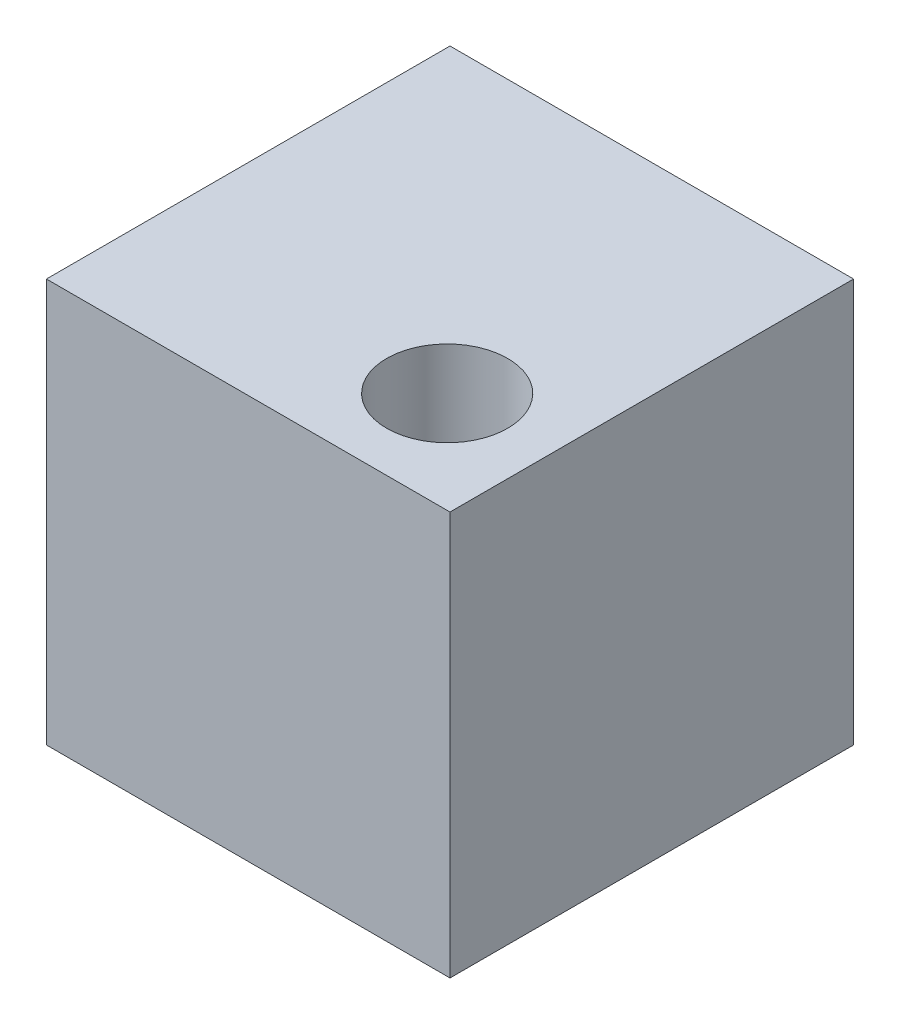
ISO-10303-21;
HEADER;
FILE_DESCRIPTION(('STEP AP214'),'2;1');
FILE_NAME('part.step','',(''),(''),'','','');
FILE_SCHEMA(('AUTOMOTIVE_DESIGN { 1 0 10303 214 1 1 1 1 }'));
ENDSEC;
DATA;
#1=APPLICATION_CONTEXT('core data for automotive mechanical design processes');
#2=APPLICATION_PROTOCOL_DEFINITION('international standard','automotive_design',2000,#1);
#3=PRODUCT_CONTEXT('',#1,'mechanical');
#4=PRODUCT('Part','Part','',(#3));
#5=PRODUCT_RELATED_PRODUCT_CATEGORY('part','',(#4));
#6=PRODUCT_DEFINITION_FORMATION('','',#4);
#7=PRODUCT_DEFINITION_CONTEXT('part definition',#1,'design');
#8=PRODUCT_DEFINITION('design','',#6,#7);
#9=PRODUCT_DEFINITION_SHAPE('','',#8);
#10=(LENGTH_UNIT() NAMED_UNIT(*) SI_UNIT(.MILLI.,.METRE.));
#11=(NAMED_UNIT(*) PLANE_ANGLE_UNIT() SI_UNIT($,.RADIAN.));
#12=(NAMED_UNIT(*) SI_UNIT($,.STERADIAN.) SOLID_ANGLE_UNIT());
#13=UNCERTAINTY_MEASURE_WITH_UNIT(LENGTH_MEASURE(1.E-05),#10,'distance_accuracy_value','');
#14=(GEOMETRIC_REPRESENTATION_CONTEXT(3) GLOBAL_UNCERTAINTY_ASSIGNED_CONTEXT((#13)) GLOBAL_UNIT_ASSIGNED_CONTEXT((#10,
#11,#12)) REPRESENTATION_CONTEXT('',''));
#15=CARTESIAN_POINT('',(0.,0.,0.));
#16=DIRECTION('',(0.,0.,1.));
#17=DIRECTION('',(1.,0.,0.));
#18=AXIS2_PLACEMENT_3D('',#15,#16,#17);
#19=CARTESIAN_POINT('',(-3.6626417244427,10.,-2.19383304201823));
#20=DIRECTION('',(1.,0.,0.));
#21=DIRECTION('',(0.,0.,-1.));
#22=AXIS2_PLACEMENT_3D('',#19,#20,#21);
#23=PLANE('',#22);
#24=DIRECTION('',(0.,0.,1.));
#25=VECTOR('',#24,1.);
#26=CARTESIAN_POINT('',(-3.6626417244427,0.,-2.19383304201823));
#27=LINE('',#26,#25);
#28=CARTESIAN_POINT('',(-3.6626417244427,0.,-2.19383304201823));
#29=VERTEX_POINT('',#28);
#30=CARTESIAN_POINT('',(-3.6626417244427,0.,7.80616695798177));
#31=VERTEX_POINT('',#30);
#32=EDGE_CURVE('E96',#29,#31,#27,.T.);
#33=ORIENTED_EDGE('',*,*,#32,.T.);
#34=DIRECTION('',(0.,-1.,0.));
#35=VECTOR('',#34,1.);
#36=CARTESIAN_POINT('',(-3.6626417244427,10.,7.80616695798177));
#37=LINE('',#36,#35);
#38=CARTESIAN_POINT('',(-3.6626417244427,10.,7.80616695798177));
#39=VERTEX_POINT('',#38);
#40=EDGE_CURVE('E11',#39,#31,#37,.T.);
#41=ORIENTED_EDGE('',*,*,#40,.F.);
#42=DIRECTION('',(0.,0.,1.));
#43=VECTOR('',#42,1.);
#44=CARTESIAN_POINT('',(-3.6626417244427,10.,-2.19383304201823));
#45=LINE('',#44,#43);
#46=CARTESIAN_POINT('',(-3.6626417244427,10.,-2.19383304201823));
#47=VERTEX_POINT('',#46);
#48=EDGE_CURVE('E84',#47,#39,#45,.T.);
#49=ORIENTED_EDGE('',*,*,#48,.F.);
#50=DIRECTION('',(0.,-1.,0.));
#51=VECTOR('',#50,1.);
#52=CARTESIAN_POINT('',(-3.6626417244427,10.,-2.19383304201823));
#53=LINE('',#52,#51);
#54=EDGE_CURVE('E92',#47,#29,#53,.T.);
#55=ORIENTED_EDGE('',*,*,#54,.T.);
#56=EDGE_LOOP('',(#33,#41,#49,#55));
#57=FACE_BOUND('',#56,.T.);
#58=ADVANCED_FACE('F33',(#57),#23,.F.);
#59=CARTESIAN_POINT('',(-3.6626417244427,10.,7.80616695798177));
#60=DIRECTION('',(0.,0.,-1.));
#61=DIRECTION('',(-1.,0.,0.));
#62=AXIS2_PLACEMENT_3D('',#59,#60,#61);
#63=PLANE('',#62);
#64=DIRECTION('',(1.,0.,0.));
#65=VECTOR('',#64,1.);
#66=CARTESIAN_POINT('',(-3.6626417244427,0.,7.80616695798177));
#67=LINE('',#66,#65);
#68=CARTESIAN_POINT('',(6.3373582755573,0.,7.80616695798177));
#69=VERTEX_POINT('',#68);
#70=EDGE_CURVE('E88',#31,#69,#67,.T.);
#71=ORIENTED_EDGE('',*,*,#70,.T.);
#72=DIRECTION('',(0.,-1.,0.));
#73=VECTOR('',#72,1.);
#74=CARTESIAN_POINT('',(6.3373582755573,10.,7.80616695798177));
#75=LINE('',#74,#73);
#76=CARTESIAN_POINT('',(6.3373582755573,10.,7.80616695798177));
#77=VERTEX_POINT('',#76);
#78=EDGE_CURVE('E41',#77,#69,#75,.T.);
#79=ORIENTED_EDGE('',*,*,#78,.F.);
#80=DIRECTION('',(1.,0.,0.));
#81=VECTOR('',#80,1.);
#82=CARTESIAN_POINT('',(-3.6626417244427,10.,7.80616695798177));
#83=LINE('',#82,#81);
#84=EDGE_CURVE('E79',#39,#77,#83,.T.);
#85=ORIENTED_EDGE('',*,*,#84,.F.);
#86=ORIENTED_EDGE('',*,*,#40,.T.);
#87=EDGE_LOOP('',(#71,#79,#85,#86));
#88=FACE_BOUND('',#87,.T.);
#89=ADVANCED_FACE('F87',(#88),#63,.F.);
#90=CARTESIAN_POINT('',(6.3373582755573,10.,-2.19383304201823));
#91=DIRECTION('',(-1.,0.,0.));
#92=DIRECTION('',(0.,0.,1.));
#93=AXIS2_PLACEMENT_3D('',#90,#91,#92);
#94=PLANE('',#93);
#95=DIRECTION('',(0.,0.,-1.));
#96=VECTOR('',#95,1.);
#97=CARTESIAN_POINT('',(6.3373582755573,0.,-2.19383304201823));
#98=LINE('',#97,#96);
#99=CARTESIAN_POINT('',(6.3373582755573,0.,-2.19383304201823));
#100=VERTEX_POINT('',#99);
#101=EDGE_CURVE('E66',#69,#100,#98,.T.);
#102=ORIENTED_EDGE('',*,*,#101,.T.);
#103=DIRECTION('',(0.,-1.,0.));
#104=VECTOR('',#103,1.);
#105=CARTESIAN_POINT('',(6.3373582755573,10.,-2.19383304201823));
#106=LINE('',#105,#104);
#107=CARTESIAN_POINT('',(6.3373582755573,10.,-2.19383304201823));
#108=VERTEX_POINT('',#107);
#109=EDGE_CURVE('E89',#108,#100,#106,.T.);
#110=ORIENTED_EDGE('',*,*,#109,.F.);
#111=DIRECTION('',(0.,0.,-1.));
#112=VECTOR('',#111,1.);
#113=CARTESIAN_POINT('',(6.3373582755573,10.,-2.19383304201823));
#114=LINE('',#113,#112);
#115=EDGE_CURVE('E82',#77,#108,#114,.T.);
#116=ORIENTED_EDGE('',*,*,#115,.F.);
#117=ORIENTED_EDGE('',*,*,#78,.T.);
#118=EDGE_LOOP('',(#102,#110,#116,#117));
#119=FACE_BOUND('',#118,.T.);
#120=ADVANCED_FACE('F90',(#119),#94,.F.);
#121=CARTESIAN_POINT('',(-3.6626417244427,10.,-2.19383304201823));
#122=DIRECTION('',(0.,0.,1.));
#123=DIRECTION('',(1.,0.,0.));
#124=AXIS2_PLACEMENT_3D('',#121,#122,#123);
#125=PLANE('',#124);
#126=DIRECTION('',(-1.,0.,0.));
#127=VECTOR('',#126,1.);
#128=CARTESIAN_POINT('',(-3.6626417244427,0.,-2.19383304201823));
#129=LINE('',#128,#127);
#130=EDGE_CURVE('E72',#100,#29,#129,.T.);
#131=ORIENTED_EDGE('',*,*,#130,.T.);
#132=ORIENTED_EDGE('',*,*,#54,.F.);
#133=DIRECTION('',(-1.,0.,0.));
#134=VECTOR('',#133,1.);
#135=CARTESIAN_POINT('',(-3.6626417244427,10.,-2.19383304201823));
#136=LINE('',#135,#134);
#137=EDGE_CURVE('E49',#108,#47,#136,.T.);
#138=ORIENTED_EDGE('',*,*,#137,.F.);
#139=ORIENTED_EDGE('',*,*,#109,.T.);
#140=EDGE_LOOP('',(#131,#132,#138,#139));
#141=FACE_BOUND('',#140,.T.);
#142=ADVANCED_FACE('F104',(#141),#125,.F.);
#143=CARTESIAN_POINT('',(0.,10.,0.));
#144=DIRECTION('',(0.,1.,0.));
#145=DIRECTION('',(0.,0.,1.));
#146=AXIS2_PLACEMENT_3D('',#143,#144,#145);
#147=PLANE('',#146);
#148=CARTESIAN_POINT('',(3.75634269897773,10.,5.29520092635494));
#149=DIRECTION('',(0.,1.,0.));
#150=DIRECTION('',(0.,0.,1.));
#151=AXIS2_PLACEMENT_3D('',#148,#149,#150);
#152=CIRCLE('',#151,1.5);
#153=CARTESIAN_POINT('',(3.75634269897773,10.,6.79520092635494));
#154=VERTEX_POINT('',#153);
#155=EDGE_CURVE('E110',#154,#154,#152,.T.);
#156=ORIENTED_EDGE('',*,*,#155,.F.);
#157=EDGE_LOOP('',(#156));
#158=FACE_BOUND('',#157,.T.);
#159=ORIENTED_EDGE('',*,*,#48,.T.);
#160=ORIENTED_EDGE('',*,*,#84,.T.);
#161=ORIENTED_EDGE('',*,*,#115,.T.);
#162=ORIENTED_EDGE('',*,*,#137,.T.);
#163=EDGE_LOOP('',(#159,#160,#161,#162));
#164=FACE_BOUND('',#163,.T.);
#165=ADVANCED_FACE('F80',(#158,#164),#147,.T.);
#166=CARTESIAN_POINT('',(0.,0.,0.));
#167=DIRECTION('',(0.,1.,0.));
#168=DIRECTION('',(0.,0.,1.));
#169=AXIS2_PLACEMENT_3D('',#166,#167,#168);
#170=PLANE('',#169);
#171=ORIENTED_EDGE('',*,*,#32,.F.);
#172=ORIENTED_EDGE('',*,*,#130,.F.);
#173=ORIENTED_EDGE('',*,*,#101,.F.);
#174=ORIENTED_EDGE('',*,*,#70,.F.);
#175=EDGE_LOOP('',(#171,#172,#173,#174));
#176=FACE_BOUND('',#175,.T.);
#177=ADVANCED_FACE('F107',(#176),#170,.F.);
#178=CARTESIAN_POINT('',(3.75634269897773,5.,5.29520092635494));
#179=DIRECTION('',(0.,1.,0.));
#180=DIRECTION('',(0.,0.,1.));
#181=AXIS2_PLACEMENT_3D('',#178,#179,#180);
#182=CYLINDRICAL_SURFACE('',#181,1.5);
#183=CARTESIAN_POINT('',(3.75634269897773,5.,5.29520092635494));
#184=DIRECTION('',(0.,1.,0.));
#185=DIRECTION('',(0.,0.,1.));
#186=AXIS2_PLACEMENT_3D('',#183,#184,#185);
#187=CIRCLE('',#186,1.5);
#188=CARTESIAN_POINT('',(3.75634269897773,5.,6.79520092635494));
#189=VERTEX_POINT('',#188);
#190=EDGE_CURVE('E99',#189,#189,#187,.T.);
#191=ORIENTED_EDGE('',*,*,#190,.F.);
#192=EDGE_LOOP('',(#191));
#193=FACE_BOUND('',#192,.T.);
#194=ORIENTED_EDGE('',*,*,#155,.T.);
#195=EDGE_LOOP('',(#194));
#196=FACE_BOUND('',#195,.T.);
#197=ADVANCED_FACE('F118',(#193,#196),#182,.F.);
#198=CARTESIAN_POINT('',(3.75634269897773,5.,5.29520092635494));
#199=DIRECTION('',(0.,1.,0.));
#200=DIRECTION('',(0.,0.,1.));
#201=AXIS2_PLACEMENT_3D('',#198,#199,#200);
#202=PLANE('',#201);
#203=ORIENTED_EDGE('',*,*,#190,.T.);
#204=EDGE_LOOP('',(#203));
#205=FACE_BOUND('',#204,.T.);
#206=ADVANCED_FACE('F116',(#205),#202,.T.);
#207=CLOSED_SHELL('',(#58,#89,#120,#142,#165,#177,#197,#206));
#208=MANIFOLD_SOLID_BREP('B2',#207);
#209=ADVANCED_BREP_SHAPE_REPRESENTATION('',(#18,#208),#14);
#210=SHAPE_DEFINITION_REPRESENTATION(#9,#209);
ENDSEC;
END-ISO-10303-21;
